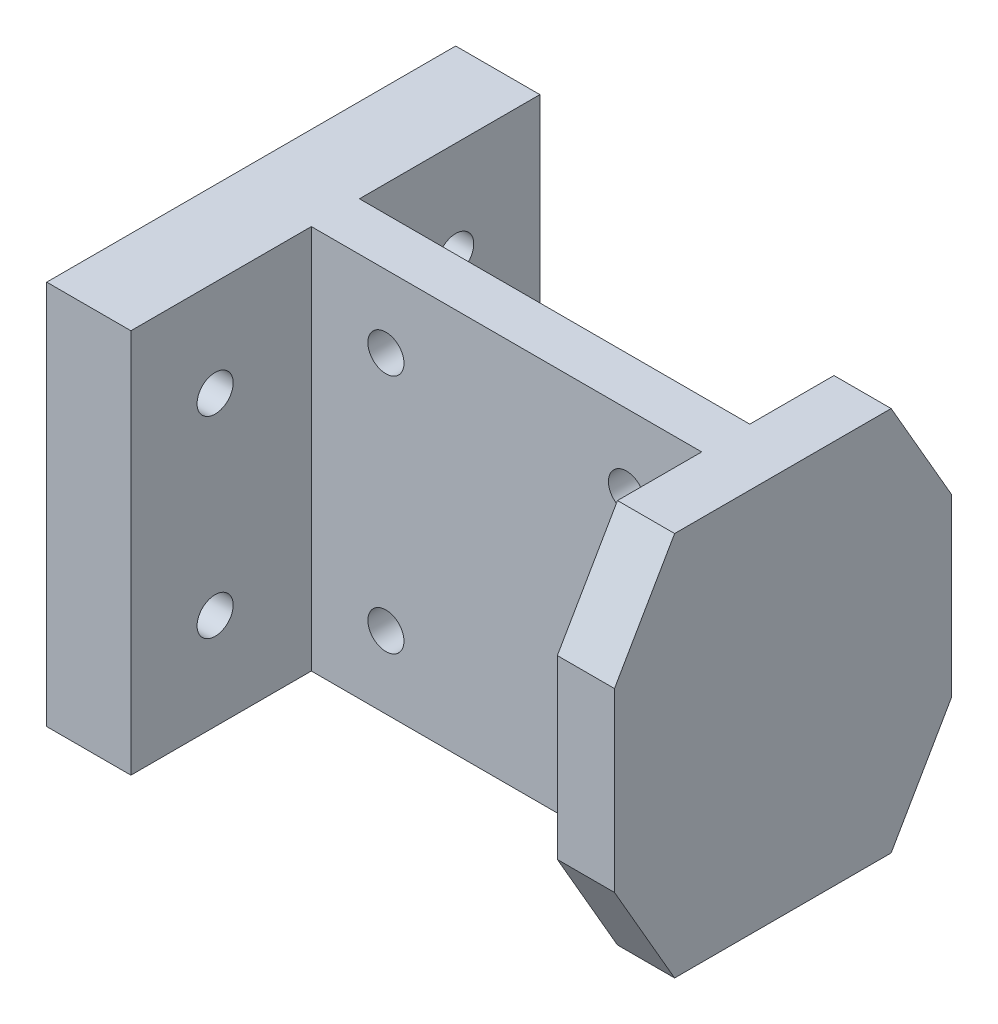
ISO-10303-21;
HEADER;
FILE_DESCRIPTION(('STEP AP214'),'2;1');
FILE_NAME('part.step','',(''),(''),'','','');
FILE_SCHEMA(('AUTOMOTIVE_DESIGN { 1 0 10303 214 1 1 1 1 }'));
ENDSEC;
DATA;
#1=APPLICATION_CONTEXT('core data for automotive mechanical design processes');
#2=APPLICATION_PROTOCOL_DEFINITION('international standard','automotive_design',2000,#1);
#3=PRODUCT_CONTEXT('',#1,'mechanical');
#4=PRODUCT('Part','Part','',(#3));
#5=PRODUCT_RELATED_PRODUCT_CATEGORY('part','',(#4));
#6=PRODUCT_DEFINITION_FORMATION('','',#4);
#7=PRODUCT_DEFINITION_CONTEXT('part definition',#1,'design');
#8=PRODUCT_DEFINITION('design','',#6,#7);
#9=PRODUCT_DEFINITION_SHAPE('','',#8);
#10=(LENGTH_UNIT() NAMED_UNIT(*) SI_UNIT(.MILLI.,.METRE.));
#11=(NAMED_UNIT(*) PLANE_ANGLE_UNIT() SI_UNIT($,.RADIAN.));
#12=(NAMED_UNIT(*) SI_UNIT($,.STERADIAN.) SOLID_ANGLE_UNIT());
#13=UNCERTAINTY_MEASURE_WITH_UNIT(LENGTH_MEASURE(1.E-05),#10,'distance_accuracy_value','');
#14=(GEOMETRIC_REPRESENTATION_CONTEXT(3) GLOBAL_UNCERTAINTY_ASSIGNED_CONTEXT((#13)) GLOBAL_UNIT_ASSIGNED_CONTEXT((#10,
#11,#12)) REPRESENTATION_CONTEXT('',''));
#15=CARTESIAN_POINT('',(0.,0.,0.));
#16=DIRECTION('',(0.,0.,1.));
#17=DIRECTION('',(1.,0.,0.));
#18=AXIS2_PLACEMENT_3D('',#15,#16,#17);
#19=CARTESIAN_POINT('',(34.,8.66025403784443,16.));
#20=DIRECTION('',(0.,-0.499999999999998,0.86602540378444));
#21=DIRECTION('',(0.,-0.86602540378444,-0.499999999999998));
#22=AXIS2_PLACEMENT_3D('',#19,#20,#21);
#23=PLANE('',#22);
#24=DIRECTION('',(1.,0.,0.));
#25=VECTOR('',#24,1.);
#26=CARTESIAN_POINT('',(34.,8.66025403784443,16.));
#27=LINE('',#26,#25);
#28=CARTESIAN_POINT('',(34.25,8.66025403784443,16.));
#29=VERTEX_POINT('',#28);
#30=CARTESIAN_POINT('',(39.,8.66025403784443,16.));
#31=VERTEX_POINT('',#30);
#32=EDGE_CURVE('E239',#29,#31,#27,.T.);
#33=ORIENTED_EDGE('',*,*,#32,.F.);
#34=DIRECTION('',(0.,0.86602540378444,0.499999999999998));
#35=VECTOR('',#34,1.);
#36=CARTESIAN_POINT('',(34.25,0.,11.));
#37=LINE('',#36,#35);
#38=CARTESIAN_POINT('',(34.25,0.,11.));
#39=VERTEX_POINT('',#38);
#40=EDGE_CURVE('E177',#39,#29,#37,.T.);
#41=ORIENTED_EDGE('',*,*,#40,.F.);
#42=DIRECTION('',(1.,0.,0.));
#43=VECTOR('',#42,1.);
#44=CARTESIAN_POINT('',(34.,0.,11.));
#45=LINE('',#44,#43);
#46=CARTESIAN_POINT('',(39.,0.,11.));
#47=VERTEX_POINT('',#46);
#48=EDGE_CURVE('E236',#39,#47,#45,.T.);
#49=ORIENTED_EDGE('',*,*,#48,.T.);
#50=DIRECTION('',(0.,-0.86602540378444,-0.499999999999998));
#51=VECTOR('',#50,1.);
#52=CARTESIAN_POINT('',(39.,8.66025403784443,16.));
#53=LINE('',#52,#51);
#54=EDGE_CURVE('E232',#31,#47,#53,.T.);
#55=ORIENTED_EDGE('',*,*,#54,.F.);
#56=EDGE_LOOP('',(#33,#41,#49,#55));
#57=FACE_BOUND('',#56,.T.);
#58=ADVANCED_FACE('F37',(#57),#23,.T.);
#59=CARTESIAN_POINT('',(34.,23.3397459621556,16.));
#60=DIRECTION('',(0.,0.,1.));
#61=DIRECTION('',(1.,0.,0.));
#62=AXIS2_PLACEMENT_3D('',#59,#60,#61);
#63=PLANE('',#62);
#64=DIRECTION('',(1.,0.,0.));
#65=VECTOR('',#64,1.);
#66=CARTESIAN_POINT('',(34.,23.3397459621556,16.));
#67=LINE('',#66,#65);
#68=CARTESIAN_POINT('',(34.25,23.3397459621556,16.));
#69=VERTEX_POINT('',#68);
#70=CARTESIAN_POINT('',(39.,23.3397459621556,16.));
#71=VERTEX_POINT('',#70);
#72=EDGE_CURVE('E241',#69,#71,#67,.T.);
#73=ORIENTED_EDGE('',*,*,#72,.F.);
#74=DIRECTION('',(0.,1.,0.));
#75=VECTOR('',#74,1.);
#76=CARTESIAN_POINT('',(34.25,8.66025403784443,16.));
#77=LINE('',#76,#75);
#78=EDGE_CURVE('E179',#29,#69,#77,.T.);
#79=ORIENTED_EDGE('',*,*,#78,.F.);
#80=ORIENTED_EDGE('',*,*,#32,.T.);
#81=DIRECTION('',(0.,-1.,0.));
#82=VECTOR('',#81,1.);
#83=CARTESIAN_POINT('',(39.,23.3397459621556,16.));
#84=LINE('',#83,#82);
#85=EDGE_CURVE('E229',#71,#31,#84,.T.);
#86=ORIENTED_EDGE('',*,*,#85,.F.);
#87=EDGE_LOOP('',(#73,#79,#80,#86));
#88=FACE_BOUND('',#87,.T.);
#89=ADVANCED_FACE('F349',(#88),#63,.T.);
#90=CARTESIAN_POINT('',(34.,32.,11.));
#91=DIRECTION('',(0.,0.499999999999998,0.86602540378444));
#92=DIRECTION('',(0.,-0.86602540378444,0.499999999999998));
#93=AXIS2_PLACEMENT_3D('',#90,#91,#92);
#94=PLANE('',#93);
#95=DIRECTION('',(1.,0.,0.));
#96=VECTOR('',#95,1.);
#97=CARTESIAN_POINT('',(34.,32.,11.));
#98=LINE('',#97,#96);
#99=CARTESIAN_POINT('',(34.25,32.,11.));
#100=VERTEX_POINT('',#99);
#101=CARTESIAN_POINT('',(39.,32.,11.));
#102=VERTEX_POINT('',#101);
#103=EDGE_CURVE('E235',#100,#102,#98,.T.);
#104=ORIENTED_EDGE('',*,*,#103,.F.);
#105=DIRECTION('',(0.,0.86602540378444,-0.499999999999998));
#106=VECTOR('',#105,1.);
#107=CARTESIAN_POINT('',(34.25,23.3397459621556,16.));
#108=LINE('',#107,#106);
#109=EDGE_CURVE('E173',#69,#100,#108,.T.);
#110=ORIENTED_EDGE('',*,*,#109,.F.);
#111=ORIENTED_EDGE('',*,*,#72,.T.);
#112=DIRECTION('',(0.,-0.86602540378444,0.499999999999998));
#113=VECTOR('',#112,1.);
#114=CARTESIAN_POINT('',(39.,32.,11.));
#115=LINE('',#114,#113);
#116=EDGE_CURVE('E226',#102,#71,#115,.T.);
#117=ORIENTED_EDGE('',*,*,#116,.F.);
#118=EDGE_LOOP('',(#104,#110,#111,#117));
#119=FACE_BOUND('',#118,.T.);
#120=ADVANCED_FACE('F353',(#119),#94,.T.);
#121=CARTESIAN_POINT('',(0.,0.,-12.));
#122=DIRECTION('',(0.,0.,-1.));
#123=DIRECTION('',(-1.,0.,0.));
#124=AXIS2_PLACEMENT_3D('',#121,#122,#123);
#125=PLANE('',#124);
#126=DIRECTION('',(1.,0.,0.));
#127=VECTOR('',#126,1.);
#128=CARTESIAN_POINT('',(24.,8.66025403784443,-12.));
#129=LINE('',#128,#127);
#130=CARTESIAN_POINT('',(34.25,8.66025403784443,-12.));
#131=VERTEX_POINT('',#130);
#132=CARTESIAN_POINT('',(39.,8.66025403784443,-12.));
#133=VERTEX_POINT('',#132);
#134=EDGE_CURVE('E246',#131,#133,#129,.T.);
#135=ORIENTED_EDGE('',*,*,#134,.F.);
#136=DIRECTION('',(0.,-1.,0.));
#137=VECTOR('',#136,1.);
#138=CARTESIAN_POINT('',(34.25,23.3397459621556,-12.));
#139=LINE('',#138,#137);
#140=CARTESIAN_POINT('',(34.25,23.3397459621556,-12.));
#141=VERTEX_POINT('',#140);
#142=EDGE_CURVE('E54',#141,#131,#139,.T.);
#143=ORIENTED_EDGE('',*,*,#142,.F.);
#144=DIRECTION('',(1.,0.,0.));
#145=VECTOR('',#144,1.);
#146=CARTESIAN_POINT('',(23.9999999999999,23.3397459621556,-12.));
#147=LINE('',#146,#145);
#148=CARTESIAN_POINT('',(39.,23.3397459621556,-12.));
#149=VERTEX_POINT('',#148);
#150=EDGE_CURVE('E61',#141,#149,#147,.T.);
#151=ORIENTED_EDGE('',*,*,#150,.T.);
#152=DIRECTION('',(0.,-1.,0.));
#153=VECTOR('',#152,1.);
#154=CARTESIAN_POINT('',(39.,32.,-12.));
#155=LINE('',#154,#153);
#156=EDGE_CURVE('E254',#149,#133,#155,.T.);
#157=ORIENTED_EDGE('',*,*,#156,.T.);
#158=EDGE_LOOP('',(#135,#143,#151,#157));
#159=FACE_BOUND('',#158,.T.);
#160=ADVANCED_FACE('F358',(#159),#125,.T.);
#161=CARTESIAN_POINT('',(23.9999999999999,23.3397459621556,-12.));
#162=DIRECTION('',(0.,-0.499999999999998,0.86602540378444));
#163=DIRECTION('',(0.,-0.86602540378444,-0.499999999999998));
#164=AXIS2_PLACEMENT_3D('',#161,#162,#163);
#165=PLANE('',#164);
#166=DIRECTION('',(0.,-0.86602540378444,-0.499999999999998));
#167=VECTOR('',#166,1.);
#168=CARTESIAN_POINT('',(34.25,32.,-7.));
#169=LINE('',#168,#167);
#170=CARTESIAN_POINT('',(34.25,32.,-7.));
#171=VERTEX_POINT('',#170);
#172=EDGE_CURVE('E182',#171,#141,#169,.T.);
#173=ORIENTED_EDGE('',*,*,#172,.F.);
#174=DIRECTION('',(1.,0.,0.));
#175=VECTOR('',#174,1.);
#176=CARTESIAN_POINT('',(23.9999999999999,32.,-7.));
#177=LINE('',#176,#175);
#178=CARTESIAN_POINT('',(39.,32.,-7.));
#179=VERTEX_POINT('',#178);
#180=EDGE_CURVE('E252',#171,#179,#177,.T.);
#181=ORIENTED_EDGE('',*,*,#180,.T.);
#182=DIRECTION('',(0.,-0.866025403784439,-0.499999999999998));
#183=VECTOR('',#182,1.);
#184=CARTESIAN_POINT('',(39.,23.3397459621556,-12.));
#185=LINE('',#184,#183);
#186=EDGE_CURVE('E249',#179,#149,#185,.T.);
#187=ORIENTED_EDGE('',*,*,#186,.T.);
#188=ORIENTED_EDGE('',*,*,#150,.F.);
#189=EDGE_LOOP('',(#173,#181,#187,#188));
#190=FACE_BOUND('',#189,.T.);
#191=ADVANCED_FACE('F357',(#190),#165,.F.);
#192=CARTESIAN_POINT('',(24.,8.66025403784443,-12.));
#193=DIRECTION('',(0.,0.499999999999998,0.86602540378444));
#194=DIRECTION('',(0.,-0.86602540378444,0.499999999999998));
#195=AXIS2_PLACEMENT_3D('',#192,#193,#194);
#196=PLANE('',#195);
#197=DIRECTION('',(0.,-0.86602540378444,0.499999999999998));
#198=VECTOR('',#197,1.);
#199=CARTESIAN_POINT('',(34.25,8.66025403784443,-12.));
#200=LINE('',#199,#198);
#201=CARTESIAN_POINT('',(34.25,0.,-7.));
#202=VERTEX_POINT('',#201);
#203=EDGE_CURVE('E185',#131,#202,#200,.T.);
#204=ORIENTED_EDGE('',*,*,#203,.F.);
#205=ORIENTED_EDGE('',*,*,#134,.T.);
#206=DIRECTION('',(0.,-0.866025403784439,0.499999999999998));
#207=VECTOR('',#206,1.);
#208=CARTESIAN_POINT('',(39.,8.66025403784443,-12.));
#209=LINE('',#208,#207);
#210=CARTESIAN_POINT('',(39.,0.,-7.));
#211=VERTEX_POINT('',#210);
#212=EDGE_CURVE('E238',#133,#211,#209,.T.);
#213=ORIENTED_EDGE('',*,*,#212,.T.);
#214=DIRECTION('',(1.,0.,0.));
#215=VECTOR('',#214,1.);
#216=CARTESIAN_POINT('',(24.,0.,-7.));
#217=LINE('',#216,#215);
#218=EDGE_CURVE('E247',#202,#211,#217,.T.);
#219=ORIENTED_EDGE('',*,*,#218,.F.);
#220=EDGE_LOOP('',(#204,#205,#213,#219));
#221=FACE_BOUND('',#220,.T.);
#222=ADVANCED_FACE('F335',(#221),#196,.F.);
#223=CARTESIAN_POINT('',(0.,0.,0.));
#224=DIRECTION('',(0.,0.,-1.));
#225=DIRECTION('',(-1.,0.,0.));
#226=AXIS2_PLACEMENT_3D('',#223,#224,#225);
#227=PLANE('',#226);
#228=DIRECTION('',(0.,-1.,0.));
#229=VECTOR('',#228,1.);
#230=CARTESIAN_POINT('',(1.79999999999999,32.,0.));
#231=LINE('',#230,#229);
#232=CARTESIAN_POINT('',(1.79999999999999,32.,0.));
#233=VERTEX_POINT('',#232);
#234=CARTESIAN_POINT('',(1.8,0.,0.));
#235=VERTEX_POINT('',#234);
#236=EDGE_CURVE('E215',#233,#235,#231,.T.);
#237=ORIENTED_EDGE('',*,*,#236,.F.);
#238=DIRECTION('',(-1.,0.,0.));
#239=VECTOR('',#238,1.);
#240=CARTESIAN_POINT('',(0.,32.,0.));
#241=LINE('',#240,#239);
#242=CARTESIAN_POINT('',(34.25,32.,0.));
#243=VERTEX_POINT('',#242);
#244=EDGE_CURVE('E41',#243,#233,#241,.T.);
#245=ORIENTED_EDGE('',*,*,#244,.F.);
#246=DIRECTION('',(0.,1.,0.));
#247=VECTOR('',#246,1.);
#248=CARTESIAN_POINT('',(34.25,0.,0.));
#249=LINE('',#248,#247);
#250=CARTESIAN_POINT('',(34.25,0.,0.));
#251=VERTEX_POINT('',#250);
#252=EDGE_CURVE('E190',#251,#243,#249,.T.);
#253=ORIENTED_EDGE('',*,*,#252,.F.);
#254=DIRECTION('',(1.,0.,0.));
#255=VECTOR('',#254,1.);
#256=CARTESIAN_POINT('',(0.,0.,0.));
#257=LINE('',#256,#255);
#258=EDGE_CURVE('E315',#235,#251,#257,.T.);
#259=ORIENTED_EDGE('',*,*,#258,.F.);
#260=EDGE_LOOP('',(#237,#245,#253,#259));
#261=FACE_BOUND('',#260,.T.);
#262=CARTESIAN_POINT('',(8.,6.,0.));
#263=DIRECTION('',(0.,0.,1.));
#264=DIRECTION('',(1.,0.,0.));
#265=AXIS2_PLACEMENT_3D('',#262,#263,#264);
#266=CIRCLE('',#265,1.5);
#267=CARTESIAN_POINT('',(9.5,6.,0.));
#268=VERTEX_POINT('',#267);
#269=EDGE_CURVE('E297',#268,#268,#266,.T.);
#270=ORIENTED_EDGE('',*,*,#269,.T.);
#271=EDGE_LOOP('',(#270));
#272=FACE_BOUND('',#271,.T.);
#273=CARTESIAN_POINT('',(7.99999999999999,26.,0.));
#274=DIRECTION('',(0.,0.,1.));
#275=DIRECTION('',(1.,0.,0.));
#276=AXIS2_PLACEMENT_3D('',#273,#274,#275);
#277=CIRCLE('',#276,1.5);
#278=CARTESIAN_POINT('',(9.49999999999999,26.,0.));
#279=VERTEX_POINT('',#278);
#280=EDGE_CURVE('E309',#279,#279,#277,.T.);
#281=ORIENTED_EDGE('',*,*,#280,.T.);
#282=EDGE_LOOP('',(#281));
#283=FACE_BOUND('',#282,.T.);
#284=CARTESIAN_POINT('',(28.,26.,0.));
#285=DIRECTION('',(0.,0.,1.));
#286=DIRECTION('',(1.,0.,0.));
#287=AXIS2_PLACEMENT_3D('',#284,#285,#286);
#288=CIRCLE('',#287,1.5);
#289=CARTESIAN_POINT('',(29.5,26.,0.));
#290=VERTEX_POINT('',#289);
#291=EDGE_CURVE('E303',#290,#290,#288,.T.);
#292=ORIENTED_EDGE('',*,*,#291,.T.);
#293=EDGE_LOOP('',(#292));
#294=FACE_BOUND('',#293,.T.);
#295=CARTESIAN_POINT('',(28.,6.00000000000001,0.));
#296=DIRECTION('',(0.,0.,1.));
#297=DIRECTION('',(1.,0.,0.));
#298=AXIS2_PLACEMENT_3D('',#295,#296,#297);
#299=CIRCLE('',#298,1.5);
#300=CARTESIAN_POINT('',(29.5,6.00000000000001,0.));
#301=VERTEX_POINT('',#300);
#302=EDGE_CURVE('E283',#301,#301,#299,.T.);
#303=ORIENTED_EDGE('',*,*,#302,.T.);
#304=EDGE_LOOP('',(#303));
#305=FACE_BOUND('',#304,.T.);
#306=ADVANCED_FACE('F328',(#261,#272,#283,#294,#305),#227,.T.);
#307=CARTESIAN_POINT('',(0.,0.,4.));
#308=DIRECTION('',(0.,0.,-1.));
#309=DIRECTION('',(-1.,0.,0.));
#310=AXIS2_PLACEMENT_3D('',#307,#308,#309);
#311=PLANE('',#310);
#312=DIRECTION('',(-1.,0.,0.));
#313=VECTOR('',#312,1.);
#314=CARTESIAN_POINT('',(0.,32.,4.));
#315=LINE('',#314,#313);
#316=CARTESIAN_POINT('',(34.25,32.,4.));
#317=VERTEX_POINT('',#316);
#318=CARTESIAN_POINT('',(1.79999999999999,32.,4.));
#319=VERTEX_POINT('',#318);
#320=EDGE_CURVE('E11',#317,#319,#315,.T.);
#321=ORIENTED_EDGE('',*,*,#320,.T.);
#322=DIRECTION('',(0.,1.,0.));
#323=VECTOR('',#322,1.);
#324=CARTESIAN_POINT('',(1.8,0.,4.));
#325=LINE('',#324,#323);
#326=CARTESIAN_POINT('',(1.8,0.,4.));
#327=VERTEX_POINT('',#326);
#328=EDGE_CURVE('E206',#327,#319,#325,.T.);
#329=ORIENTED_EDGE('',*,*,#328,.F.);
#330=DIRECTION('',(1.,0.,0.));
#331=VECTOR('',#330,1.);
#332=CARTESIAN_POINT('',(0.,0.,4.));
#333=LINE('',#332,#331);
#334=CARTESIAN_POINT('',(34.25,0.,4.));
#335=VERTEX_POINT('',#334);
#336=EDGE_CURVE('E46',#327,#335,#333,.T.);
#337=ORIENTED_EDGE('',*,*,#336,.T.);
#338=DIRECTION('',(0.,-1.,0.));
#339=VECTOR('',#338,1.);
#340=CARTESIAN_POINT('',(34.25,32.,4.));
#341=LINE('',#340,#339);
#342=EDGE_CURVE('E163',#317,#335,#341,.T.);
#343=ORIENTED_EDGE('',*,*,#342,.F.);
#344=EDGE_LOOP('',(#321,#329,#337,#343));
#345=FACE_BOUND('',#344,.T.);
#346=CARTESIAN_POINT('',(7.99999999999999,26.,4.));
#347=DIRECTION('',(0.,0.,1.));
#348=DIRECTION('',(1.,0.,0.));
#349=AXIS2_PLACEMENT_3D('',#346,#347,#348);
#350=CIRCLE('',#349,1.5);
#351=CARTESIAN_POINT('',(9.49999999999999,26.,4.));
#352=VERTEX_POINT('',#351);
#353=EDGE_CURVE('E312',#352,#352,#350,.T.);
#354=ORIENTED_EDGE('',*,*,#353,.F.);
#355=EDGE_LOOP('',(#354));
#356=FACE_BOUND('',#355,.T.);
#357=CARTESIAN_POINT('',(28.,26.,4.));
#358=DIRECTION('',(0.,0.,1.));
#359=DIRECTION('',(1.,0.,0.));
#360=AXIS2_PLACEMENT_3D('',#357,#358,#359);
#361=CIRCLE('',#360,1.5);
#362=CARTESIAN_POINT('',(29.5,26.,4.));
#363=VERTEX_POINT('',#362);
#364=EDGE_CURVE('E306',#363,#363,#361,.T.);
#365=ORIENTED_EDGE('',*,*,#364,.F.);
#366=EDGE_LOOP('',(#365));
#367=FACE_BOUND('',#366,.T.);
#368=CARTESIAN_POINT('',(8.,6.,4.));
#369=DIRECTION('',(0.,0.,1.));
#370=DIRECTION('',(1.,0.,0.));
#371=AXIS2_PLACEMENT_3D('',#368,#369,#370);
#372=CIRCLE('',#371,1.5);
#373=CARTESIAN_POINT('',(9.5,6.,4.));
#374=VERTEX_POINT('',#373);
#375=EDGE_CURVE('E300',#374,#374,#372,.T.);
#376=ORIENTED_EDGE('',*,*,#375,.F.);
#377=EDGE_LOOP('',(#376));
#378=FACE_BOUND('',#377,.T.);
#379=CARTESIAN_POINT('',(28.,6.00000000000001,4.));
#380=DIRECTION('',(0.,0.,1.));
#381=DIRECTION('',(1.,0.,0.));
#382=AXIS2_PLACEMENT_3D('',#379,#380,#381);
#383=CIRCLE('',#382,1.5);
#384=CARTESIAN_POINT('',(29.5,6.00000000000001,4.));
#385=VERTEX_POINT('',#384);
#386=EDGE_CURVE('E294',#385,#385,#383,.T.);
#387=ORIENTED_EDGE('',*,*,#386,.F.);
#388=EDGE_LOOP('',(#387));
#389=FACE_BOUND('',#388,.T.);
#390=ADVANCED_FACE('F164',(#345,#356,#367,#378,#389),#311,.F.);
#391=CARTESIAN_POINT('',(0.,0.,4.));
#392=DIRECTION('',(0.,1.,0.));
#393=DIRECTION('',(-1.,0.,0.));
#394=AXIS2_PLACEMENT_3D('',#391,#392,#393);
#395=PLANE('',#394);
#396=DIRECTION('',(0.,0.,1.));
#397=VECTOR('',#396,1.);
#398=CARTESIAN_POINT('',(34.25,0.,4.));
#399=LINE('',#398,#397);
#400=EDGE_CURVE('E169',#335,#39,#399,.T.);
#401=ORIENTED_EDGE('',*,*,#400,.F.);
#402=ORIENTED_EDGE('',*,*,#336,.F.);
#403=DIRECTION('',(0.,0.,-1.));
#404=VECTOR('',#403,1.);
#405=CARTESIAN_POINT('',(1.8,0.,19.));
#406=LINE('',#405,#404);
#407=CARTESIAN_POINT('',(1.8,0.,19.));
#408=VERTEX_POINT('',#407);
#409=EDGE_CURVE('E204',#408,#327,#406,.T.);
#410=ORIENTED_EDGE('',*,*,#409,.F.);
#411=DIRECTION('',(-1.,0.,0.));
#412=VECTOR('',#411,1.);
#413=CARTESIAN_POINT('',(-1.2,0.,19.));
#414=LINE('',#413,#412);
#415=CARTESIAN_POINT('',(-5.2,0.,19.));
#416=VERTEX_POINT('',#415);
#417=EDGE_CURVE('E281',#408,#416,#414,.T.);
#418=ORIENTED_EDGE('',*,*,#417,.T.);
#419=DIRECTION('',(0.,0.,-1.));
#420=VECTOR('',#419,1.);
#421=CARTESIAN_POINT('',(-5.2,0.,19.));
#422=LINE('',#421,#420);
#423=CARTESIAN_POINT('',(-5.20000000000001,0.,-15.));
#424=VERTEX_POINT('',#423);
#425=EDGE_CURVE('E278',#416,#424,#422,.T.);
#426=ORIENTED_EDGE('',*,*,#425,.T.);
#427=DIRECTION('',(1.,0.,0.));
#428=VECTOR('',#427,1.);
#429=CARTESIAN_POINT('',(-5.2,0.,-15.));
#430=LINE('',#429,#428);
#431=CARTESIAN_POINT('',(1.8,0.,-15.));
#432=VERTEX_POINT('',#431);
#433=EDGE_CURVE('E276',#424,#432,#430,.T.);
#434=ORIENTED_EDGE('',*,*,#433,.T.);
#435=DIRECTION('',(0.,0.,-1.));
#436=VECTOR('',#435,1.);
#437=CARTESIAN_POINT('',(1.8,0.,0.));
#438=LINE('',#437,#436);
#439=EDGE_CURVE('E218',#235,#432,#438,.T.);
#440=ORIENTED_EDGE('',*,*,#439,.F.);
#441=ORIENTED_EDGE('',*,*,#258,.T.);
#442=DIRECTION('',(0.,0.,1.));
#443=VECTOR('',#442,1.);
#444=CARTESIAN_POINT('',(34.25,0.,-7.));
#445=LINE('',#444,#443);
#446=EDGE_CURVE('E187',#202,#251,#445,.T.);
#447=ORIENTED_EDGE('',*,*,#446,.F.);
#448=ORIENTED_EDGE('',*,*,#218,.T.);
#449=DIRECTION('',(0.,0.,-1.));
#450=VECTOR('',#449,1.);
#451=CARTESIAN_POINT('',(39.,0.,4.));
#452=LINE('',#451,#450);
#453=EDGE_CURVE('E257',#47,#211,#452,.T.);
#454=ORIENTED_EDGE('',*,*,#453,.F.);
#455=ORIENTED_EDGE('',*,*,#48,.F.);
#456=EDGE_LOOP('',(#401,#402,#410,#418,#426,#434,#440,#441,#447,#448,#454,#455));
#457=FACE_BOUND('',#456,.T.);
#458=ADVANCED_FACE('F39',(#457),#395,.F.);
#459=CARTESIAN_POINT('',(0.,32.,4.));
#460=DIRECTION('',(0.,-1.,0.));
#461=DIRECTION('',(1.,0.,0.));
#462=AXIS2_PLACEMENT_3D('',#459,#460,#461);
#463=PLANE('',#462);
#464=ORIENTED_EDGE('',*,*,#320,.F.);
#465=DIRECTION('',(0.,0.,-1.));
#466=VECTOR('',#465,1.);
#467=CARTESIAN_POINT('',(34.25,32.,11.));
#468=LINE('',#467,#466);
#469=EDGE_CURVE('E156',#100,#317,#468,.T.);
#470=ORIENTED_EDGE('',*,*,#469,.F.);
#471=ORIENTED_EDGE('',*,*,#103,.T.);
#472=DIRECTION('',(0.,0.,1.));
#473=VECTOR('',#472,1.);
#474=CARTESIAN_POINT('',(39.,32.,0.));
#475=LINE('',#474,#473);
#476=EDGE_CURVE('E260',#179,#102,#475,.T.);
#477=ORIENTED_EDGE('',*,*,#476,.F.);
#478=ORIENTED_EDGE('',*,*,#180,.F.);
#479=DIRECTION('',(0.,0.,-1.));
#480=VECTOR('',#479,1.);
#481=CARTESIAN_POINT('',(34.25,32.,0.));
#482=LINE('',#481,#480);
#483=EDGE_CURVE('E193',#243,#171,#482,.T.);
#484=ORIENTED_EDGE('',*,*,#483,.F.);
#485=ORIENTED_EDGE('',*,*,#244,.T.);
#486=DIRECTION('',(0.,0.,1.));
#487=VECTOR('',#486,1.);
#488=CARTESIAN_POINT('',(1.79999999999999,32.,-15.));
#489=LINE('',#488,#487);
#490=CARTESIAN_POINT('',(1.79999999999999,32.,-15.));
#491=VERTEX_POINT('',#490);
#492=EDGE_CURVE('E224',#491,#233,#489,.T.);
#493=ORIENTED_EDGE('',*,*,#492,.F.);
#494=DIRECTION('',(-1.,0.,0.));
#495=VECTOR('',#494,1.);
#496=CARTESIAN_POINT('',(-5.20000000000001,32.,-15.));
#497=LINE('',#496,#495);
#498=CARTESIAN_POINT('',(-5.20000000000001,32.,-15.));
#499=VERTEX_POINT('',#498);
#500=EDGE_CURVE('E275',#491,#499,#497,.T.);
#501=ORIENTED_EDGE('',*,*,#500,.T.);
#502=DIRECTION('',(0.,0.,1.));
#503=VECTOR('',#502,1.);
#504=CARTESIAN_POINT('',(-5.20000000000001,32.,19.));
#505=LINE('',#504,#503);
#506=CARTESIAN_POINT('',(-5.20000000000001,32.,19.));
#507=VERTEX_POINT('',#506);
#508=EDGE_CURVE('E286',#499,#507,#505,.T.);
#509=ORIENTED_EDGE('',*,*,#508,.T.);
#510=DIRECTION('',(1.,0.,0.));
#511=VECTOR('',#510,1.);
#512=CARTESIAN_POINT('',(-1.20000000000001,32.,19.));
#513=LINE('',#512,#511);
#514=CARTESIAN_POINT('',(1.79999999999999,32.,19.));
#515=VERTEX_POINT('',#514);
#516=EDGE_CURVE('E289',#507,#515,#513,.T.);
#517=ORIENTED_EDGE('',*,*,#516,.T.);
#518=DIRECTION('',(0.,0.,1.));
#519=VECTOR('',#518,1.);
#520=CARTESIAN_POINT('',(1.79999999999999,32.,4.));
#521=LINE('',#520,#519);
#522=EDGE_CURVE('E159',#319,#515,#521,.T.);
#523=ORIENTED_EDGE('',*,*,#522,.F.);
#524=EDGE_LOOP('',(#464,#470,#471,#477,#478,#484,#485,#493,#501,#509,#517,#523));
#525=FACE_BOUND('',#524,.T.);
#526=ADVANCED_FACE('F154',(#525),#463,.F.);
#527=CARTESIAN_POINT('',(7.99999999999999,26.,4.));
#528=DIRECTION('',(0.,0.,-1.));
#529=DIRECTION('',(-1.,0.,0.));
#530=AXIS2_PLACEMENT_3D('',#527,#528,#529);
#531=CYLINDRICAL_SURFACE('',#530,1.5);
#532=ORIENTED_EDGE('',*,*,#353,.T.);
#533=EDGE_LOOP('',(#532));
#534=FACE_BOUND('',#533,.T.);
#535=ORIENTED_EDGE('',*,*,#280,.F.);
#536=EDGE_LOOP('',(#535));
#537=FACE_BOUND('',#536,.T.);
#538=ADVANCED_FACE('F391',(#534,#537),#531,.F.);
#539=CARTESIAN_POINT('',(28.,26.,4.));
#540=DIRECTION('',(0.,0.,-1.));
#541=DIRECTION('',(-1.,0.,0.));
#542=AXIS2_PLACEMENT_3D('',#539,#540,#541);
#543=CYLINDRICAL_SURFACE('',#542,1.5);
#544=ORIENTED_EDGE('',*,*,#364,.T.);
#545=EDGE_LOOP('',(#544));
#546=FACE_BOUND('',#545,.T.);
#547=ORIENTED_EDGE('',*,*,#291,.F.);
#548=EDGE_LOOP('',(#547));
#549=FACE_BOUND('',#548,.T.);
#550=ADVANCED_FACE('F397',(#546,#549),#543,.F.);
#551=CARTESIAN_POINT('',(8.,6.,4.));
#552=DIRECTION('',(0.,0.,-1.));
#553=DIRECTION('',(-1.,0.,0.));
#554=AXIS2_PLACEMENT_3D('',#551,#552,#553);
#555=CYLINDRICAL_SURFACE('',#554,1.5);
#556=ORIENTED_EDGE('',*,*,#375,.T.);
#557=EDGE_LOOP('',(#556));
#558=FACE_BOUND('',#557,.T.);
#559=ORIENTED_EDGE('',*,*,#269,.F.);
#560=EDGE_LOOP('',(#559));
#561=FACE_BOUND('',#560,.T.);
#562=ADVANCED_FACE('F604',(#558,#561),#555,.F.);
#563=CARTESIAN_POINT('',(28.,6.00000000000001,4.));
#564=DIRECTION('',(0.,0.,-1.));
#565=DIRECTION('',(-1.,0.,0.));
#566=AXIS2_PLACEMENT_3D('',#563,#564,#565);
#567=CYLINDRICAL_SURFACE('',#566,1.5);
#568=ORIENTED_EDGE('',*,*,#386,.T.);
#569=EDGE_LOOP('',(#568));
#570=FACE_BOUND('',#569,.T.);
#571=ORIENTED_EDGE('',*,*,#302,.F.);
#572=EDGE_LOOP('',(#571));
#573=FACE_BOUND('',#572,.T.);
#574=ADVANCED_FACE('F533',(#570,#573),#567,.F.);
#575=CARTESIAN_POINT('',(-1.19999999999999,-34.3953485227291,19.));
#576=DIRECTION('',(0.,0.,1.));
#577=DIRECTION('',(1.,0.,0.));
#578=AXIS2_PLACEMENT_3D('',#575,#576,#577);
#579=PLANE('',#578);
#580=ORIENTED_EDGE('',*,*,#417,.F.);
#581=DIRECTION('',(0.,-1.,0.));
#582=VECTOR('',#581,1.);
#583=CARTESIAN_POINT('',(1.79999999999999,32.,19.));
#584=LINE('',#583,#582);
#585=EDGE_CURVE('E201',#515,#408,#584,.T.);
#586=ORIENTED_EDGE('',*,*,#585,.F.);
#587=ORIENTED_EDGE('',*,*,#516,.F.);
#588=DIRECTION('',(0.,1.,0.));
#589=VECTOR('',#588,1.);
#590=CARTESIAN_POINT('',(-5.2,-34.3953485227291,19.));
#591=LINE('',#590,#589);
#592=EDGE_CURVE('E279',#416,#507,#591,.T.);
#593=ORIENTED_EDGE('',*,*,#592,.F.);
#594=EDGE_LOOP('',(#580,#586,#587,#593));
#595=FACE_BOUND('',#594,.T.);
#596=ADVANCED_FACE('F528',(#595),#579,.T.);
#597=CARTESIAN_POINT('',(-5.2,-34.3953485227291,19.));
#598=DIRECTION('',(-1.,0.,0.));
#599=DIRECTION('',(0.,-1.,0.));
#600=AXIS2_PLACEMENT_3D('',#597,#598,#599);
#601=PLANE('',#600);
#602=CARTESIAN_POINT('',(-5.20000000000002,24.,12.));
#603=DIRECTION('',(1.,0.,0.));
#604=DIRECTION('',(0.,1.,0.));
#605=AXIS2_PLACEMENT_3D('',#602,#603,#604);
#606=CIRCLE('',#605,1.5);
#607=CARTESIAN_POINT('',(-5.20000000000002,25.5,12.));
#608=VERTEX_POINT('',#607);
#609=EDGE_CURVE('E263',#608,#608,#606,.T.);
#610=ORIENTED_EDGE('',*,*,#609,.T.);
#611=EDGE_LOOP('',(#610));
#612=FACE_BOUND('',#611,.T.);
#613=CARTESIAN_POINT('',(-5.20000000000001,8.,12.));
#614=DIRECTION('',(1.,0.,0.));
#615=DIRECTION('',(0.,1.,0.));
#616=AXIS2_PLACEMENT_3D('',#613,#614,#615);
#617=CIRCLE('',#616,1.5);
#618=CARTESIAN_POINT('',(-5.20000000000001,9.5,12.));
#619=VERTEX_POINT('',#618);
#620=EDGE_CURVE('E266',#619,#619,#617,.T.);
#621=ORIENTED_EDGE('',*,*,#620,.T.);
#622=EDGE_LOOP('',(#621));
#623=FACE_BOUND('',#622,.T.);
#624=CARTESIAN_POINT('',(-5.20000000000001,8.,-8.00000000000001));
#625=DIRECTION('',(1.,0.,0.));
#626=DIRECTION('',(0.,1.,0.));
#627=AXIS2_PLACEMENT_3D('',#624,#625,#626);
#628=CIRCLE('',#627,1.5);
#629=CARTESIAN_POINT('',(-5.20000000000001,9.5,-8.00000000000001));
#630=VERTEX_POINT('',#629);
#631=EDGE_CURVE('E269',#630,#630,#628,.T.);
#632=ORIENTED_EDGE('',*,*,#631,.T.);
#633=EDGE_LOOP('',(#632));
#634=FACE_BOUND('',#633,.T.);
#635=CARTESIAN_POINT('',(-5.20000000000002,24.,-8.));
#636=DIRECTION('',(1.,0.,0.));
#637=DIRECTION('',(0.,1.,0.));
#638=AXIS2_PLACEMENT_3D('',#635,#636,#637);
#639=CIRCLE('',#638,1.5);
#640=CARTESIAN_POINT('',(-5.20000000000002,25.5,-8.));
#641=VERTEX_POINT('',#640);
#642=EDGE_CURVE('E272',#641,#641,#639,.T.);
#643=ORIENTED_EDGE('',*,*,#642,.T.);
#644=EDGE_LOOP('',(#643));
#645=FACE_BOUND('',#644,.T.);
#646=ORIENTED_EDGE('',*,*,#425,.F.);
#647=ORIENTED_EDGE('',*,*,#592,.T.);
#648=ORIENTED_EDGE('',*,*,#508,.F.);
#649=DIRECTION('',(0.,1.,0.));
#650=VECTOR('',#649,1.);
#651=CARTESIAN_POINT('',(-5.2,-34.3953485227291,-15.));
#652=LINE('',#651,#650);
#653=EDGE_CURVE('E291',#424,#499,#652,.T.);
#654=ORIENTED_EDGE('',*,*,#653,.F.);
#655=EDGE_LOOP('',(#646,#647,#648,#654));
#656=FACE_BOUND('',#655,.T.);
#657=ADVANCED_FACE('F520',(#612,#623,#634,#645,#656),#601,.T.);
#658=CARTESIAN_POINT('',(-5.2,-34.3953485227291,-15.));
#659=DIRECTION('',(0.,0.,-1.));
#660=DIRECTION('',(-1.,0.,0.));
#661=AXIS2_PLACEMENT_3D('',#658,#659,#660);
#662=PLANE('',#661);
#663=ORIENTED_EDGE('',*,*,#433,.F.);
#664=ORIENTED_EDGE('',*,*,#653,.T.);
#665=ORIENTED_EDGE('',*,*,#500,.F.);
#666=DIRECTION('',(0.,1.,0.));
#667=VECTOR('',#666,1.);
#668=CARTESIAN_POINT('',(1.8,0.,-15.));
#669=LINE('',#668,#667);
#670=EDGE_CURVE('E221',#432,#491,#669,.T.);
#671=ORIENTED_EDGE('',*,*,#670,.F.);
#672=EDGE_LOOP('',(#663,#664,#665,#671));
#673=FACE_BOUND('',#672,.T.);
#674=ADVANCED_FACE('F508',(#673),#662,.T.);
#675=CARTESIAN_POINT('',(-5.20000000000002,24.,-8.));
#676=DIRECTION('',(1.,0.,0.));
#677=DIRECTION('',(0.,1.,0.));
#678=AXIS2_PLACEMENT_3D('',#675,#676,#677);
#679=CYLINDRICAL_SURFACE('',#678,1.5);
#680=ORIENTED_EDGE('',*,*,#642,.F.);
#681=EDGE_LOOP('',(#680));
#682=FACE_BOUND('',#681,.T.);
#683=CARTESIAN_POINT('',(1.79999999999999,24.,-8.));
#684=DIRECTION('',(1.,0.,0.));
#685=DIRECTION('',(0.,1.,0.));
#686=AXIS2_PLACEMENT_3D('',#683,#684,#685);
#687=CIRCLE('',#686,1.5);
#688=CARTESIAN_POINT('',(1.79999999999999,25.5,-8.));
#689=VERTEX_POINT('',#688);
#690=EDGE_CURVE('E212',#689,#689,#687,.T.);
#691=ORIENTED_EDGE('',*,*,#690,.T.);
#692=EDGE_LOOP('',(#691));
#693=FACE_BOUND('',#692,.T.);
#694=ADVANCED_FACE('F496',(#682,#693),#679,.F.);
#695=CARTESIAN_POINT('',(-5.20000000000001,8.,-8.00000000000001));
#696=DIRECTION('',(1.,0.,0.));
#697=DIRECTION('',(0.,1.,0.));
#698=AXIS2_PLACEMENT_3D('',#695,#696,#697);
#699=CYLINDRICAL_SURFACE('',#698,1.5);
#700=ORIENTED_EDGE('',*,*,#631,.F.);
#701=EDGE_LOOP('',(#700));
#702=FACE_BOUND('',#701,.T.);
#703=CARTESIAN_POINT('',(1.8,8.,-8.00000000000001));
#704=DIRECTION('',(1.,0.,0.));
#705=DIRECTION('',(0.,1.,0.));
#706=AXIS2_PLACEMENT_3D('',#703,#704,#705);
#707=CIRCLE('',#706,1.5);
#708=CARTESIAN_POINT('',(1.8,9.5,-8.00000000000001));
#709=VERTEX_POINT('',#708);
#710=EDGE_CURVE('E209',#709,#709,#707,.T.);
#711=ORIENTED_EDGE('',*,*,#710,.T.);
#712=EDGE_LOOP('',(#711));
#713=FACE_BOUND('',#712,.T.);
#714=ADVANCED_FACE('F484',(#702,#713),#699,.F.);
#715=CARTESIAN_POINT('',(-5.20000000000001,8.,12.));
#716=DIRECTION('',(1.,0.,0.));
#717=DIRECTION('',(0.,1.,0.));
#718=AXIS2_PLACEMENT_3D('',#715,#716,#717);
#719=CYLINDRICAL_SURFACE('',#718,1.5);
#720=ORIENTED_EDGE('',*,*,#620,.F.);
#721=EDGE_LOOP('',(#720));
#722=FACE_BOUND('',#721,.T.);
#723=CARTESIAN_POINT('',(1.8,8.,12.));
#724=DIRECTION('',(1.,0.,0.));
#725=DIRECTION('',(0.,1.,0.));
#726=AXIS2_PLACEMENT_3D('',#723,#724,#725);
#727=CIRCLE('',#726,1.5);
#728=CARTESIAN_POINT('',(1.8,9.5,12.));
#729=VERTEX_POINT('',#728);
#730=EDGE_CURVE('E195',#729,#729,#727,.T.);
#731=ORIENTED_EDGE('',*,*,#730,.T.);
#732=EDGE_LOOP('',(#731));
#733=FACE_BOUND('',#732,.T.);
#734=ADVANCED_FACE('F472',(#722,#733),#719,.F.);
#735=CARTESIAN_POINT('',(-5.20000000000002,24.,12.));
#736=DIRECTION('',(1.,0.,0.));
#737=DIRECTION('',(0.,1.,0.));
#738=AXIS2_PLACEMENT_3D('',#735,#736,#737);
#739=CYLINDRICAL_SURFACE('',#738,1.5);
#740=ORIENTED_EDGE('',*,*,#609,.F.);
#741=EDGE_LOOP('',(#740));
#742=FACE_BOUND('',#741,.T.);
#743=CARTESIAN_POINT('',(1.79999999999999,24.,12.));
#744=DIRECTION('',(1.,0.,0.));
#745=DIRECTION('',(0.,1.,0.));
#746=AXIS2_PLACEMENT_3D('',#743,#744,#745);
#747=CIRCLE('',#746,1.5);
#748=CARTESIAN_POINT('',(1.79999999999999,25.5,12.));
#749=VERTEX_POINT('',#748);
#750=EDGE_CURVE('E198',#749,#749,#747,.T.);
#751=ORIENTED_EDGE('',*,*,#750,.T.);
#752=EDGE_LOOP('',(#751));
#753=FACE_BOUND('',#752,.T.);
#754=ADVANCED_FACE('F466',(#742,#753),#739,.F.);
#755=CARTESIAN_POINT('',(39.,0.,0.));
#756=DIRECTION('',(1.,0.,0.));
#757=DIRECTION('',(0.,1.,0.));
#758=AXIS2_PLACEMENT_3D('',#755,#756,#757);
#759=PLANE('',#758);
#760=ORIENTED_EDGE('',*,*,#212,.F.);
#761=ORIENTED_EDGE('',*,*,#156,.F.);
#762=ORIENTED_EDGE('',*,*,#186,.F.);
#763=ORIENTED_EDGE('',*,*,#476,.T.);
#764=ORIENTED_EDGE('',*,*,#116,.T.);
#765=ORIENTED_EDGE('',*,*,#85,.T.);
#766=ORIENTED_EDGE('',*,*,#54,.T.);
#767=ORIENTED_EDGE('',*,*,#453,.T.);
#768=EDGE_LOOP('',(#760,#761,#762,#763,#764,#765,#766,#767));
#769=FACE_BOUND('',#768,.T.);
#770=ADVANCED_FACE('F340',(#769),#759,.T.);
#771=CARTESIAN_POINT('',(1.8,0.,0.));
#772=DIRECTION('',(1.,0.,0.));
#773=DIRECTION('',(0.,1.,0.));
#774=AXIS2_PLACEMENT_3D('',#771,#772,#773);
#775=PLANE('',#774);
#776=ORIENTED_EDGE('',*,*,#690,.F.);
#777=EDGE_LOOP('',(#776));
#778=FACE_BOUND('',#777,.T.);
#779=ORIENTED_EDGE('',*,*,#236,.T.);
#780=ORIENTED_EDGE('',*,*,#439,.T.);
#781=ORIENTED_EDGE('',*,*,#670,.T.);
#782=ORIENTED_EDGE('',*,*,#492,.T.);
#783=EDGE_LOOP('',(#779,#780,#781,#782));
#784=FACE_BOUND('',#783,.T.);
#785=ORIENTED_EDGE('',*,*,#710,.F.);
#786=EDGE_LOOP('',(#785));
#787=FACE_BOUND('',#786,.T.);
#788=ADVANCED_FACE('F376',(#778,#784,#787),#775,.T.);
#789=CARTESIAN_POINT('',(1.8,0.,0.));
#790=DIRECTION('',(1.,0.,0.));
#791=DIRECTION('',(0.,1.,0.));
#792=AXIS2_PLACEMENT_3D('',#789,#790,#791);
#793=PLANE('',#792);
#794=ORIENTED_EDGE('',*,*,#750,.F.);
#795=EDGE_LOOP('',(#794));
#796=FACE_BOUND('',#795,.T.);
#797=ORIENTED_EDGE('',*,*,#585,.T.);
#798=ORIENTED_EDGE('',*,*,#409,.T.);
#799=ORIENTED_EDGE('',*,*,#328,.T.);
#800=ORIENTED_EDGE('',*,*,#522,.T.);
#801=EDGE_LOOP('',(#797,#798,#799,#800));
#802=FACE_BOUND('',#801,.T.);
#803=ORIENTED_EDGE('',*,*,#730,.F.);
#804=EDGE_LOOP('',(#803));
#805=FACE_BOUND('',#804,.T.);
#806=ADVANCED_FACE('F451',(#796,#802,#805),#793,.T.);
#807=CARTESIAN_POINT('',(34.25,0.,0.));
#808=DIRECTION('',(-1.,0.,0.));
#809=DIRECTION('',(0.,0.,1.));
#810=AXIS2_PLACEMENT_3D('',#807,#808,#809);
#811=PLANE('',#810);
#812=ORIENTED_EDGE('',*,*,#172,.T.);
#813=ORIENTED_EDGE('',*,*,#142,.T.);
#814=ORIENTED_EDGE('',*,*,#203,.T.);
#815=ORIENTED_EDGE('',*,*,#446,.T.);
#816=ORIENTED_EDGE('',*,*,#252,.T.);
#817=ORIENTED_EDGE('',*,*,#483,.T.);
#818=EDGE_LOOP('',(#812,#813,#814,#815,#816,#817));
#819=FACE_BOUND('',#818,.T.);
#820=ADVANCED_FACE('F330',(#819),#811,.T.);
#821=CARTESIAN_POINT('',(34.25,0.,0.));
#822=DIRECTION('',(-1.,0.,0.));
#823=DIRECTION('',(0.,-1.,0.));
#824=AXIS2_PLACEMENT_3D('',#821,#822,#823);
#825=PLANE('',#824);
#826=ORIENTED_EDGE('',*,*,#469,.T.);
#827=ORIENTED_EDGE('',*,*,#342,.T.);
#828=ORIENTED_EDGE('',*,*,#400,.T.);
#829=ORIENTED_EDGE('',*,*,#40,.T.);
#830=ORIENTED_EDGE('',*,*,#78,.T.);
#831=ORIENTED_EDGE('',*,*,#109,.T.);
#832=EDGE_LOOP('',(#826,#827,#828,#829,#830,#831));
#833=FACE_BOUND('',#832,.T.);
#834=ADVANCED_FACE('F171',(#833),#825,.T.);
#835=CLOSED_SHELL('',(#58,#89,#120,#160,#191,#222,#306,#390,#458,#526,#538,#550,#562,#574,#596,
#657,#674,#694,#714,#734,#754,#770,#788,#806,#820,#834));
#836=MANIFOLD_SOLID_BREP('B2',#835);
#837=ADVANCED_BREP_SHAPE_REPRESENTATION('',(#18,#836),#14);
#838=SHAPE_DEFINITION_REPRESENTATION(#9,#837);
ENDSEC;
END-ISO-10303-21;
